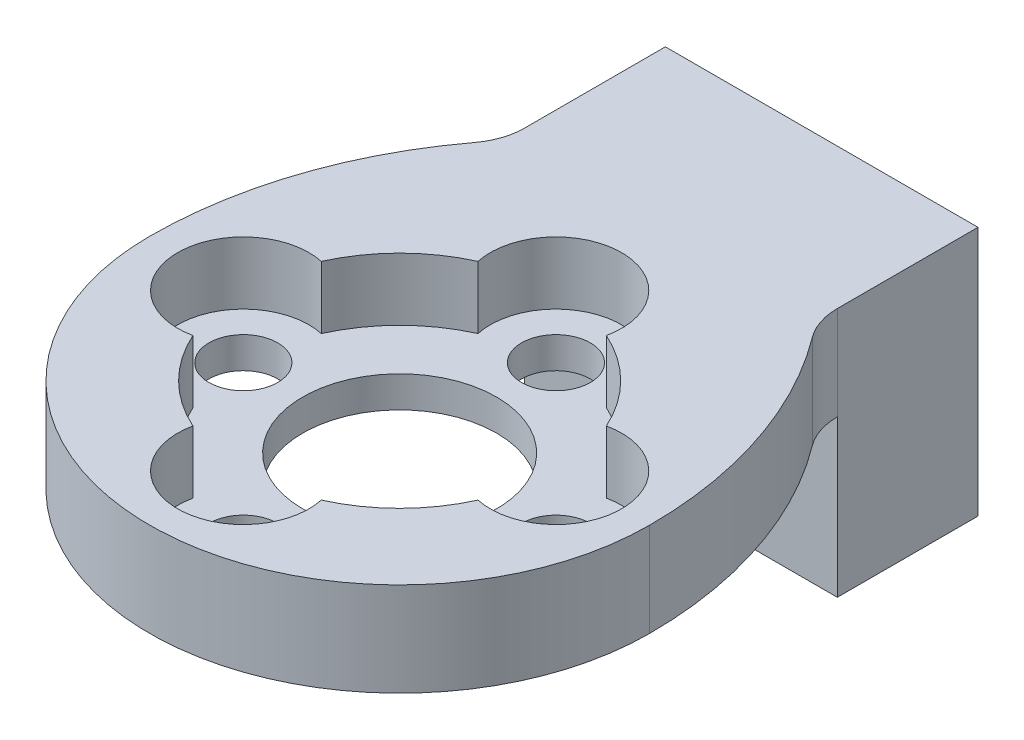
ISO-10303-21;
HEADER;
FILE_DESCRIPTION(('STEP AP214'),'2;1');
FILE_NAME('part.step','',(''),(''),'','','');
FILE_SCHEMA(('AUTOMOTIVE_DESIGN { 1 0 10303 214 1 1 1 1 }'));
ENDSEC;
DATA;
#1=APPLICATION_CONTEXT('core data for automotive mechanical design processes');
#2=APPLICATION_PROTOCOL_DEFINITION('international standard','automotive_design',2000,#1);
#3=PRODUCT_CONTEXT('',#1,'mechanical');
#4=PRODUCT('Part','Part','',(#3));
#5=PRODUCT_RELATED_PRODUCT_CATEGORY('part','',(#4));
#6=PRODUCT_DEFINITION_FORMATION('','',#4);
#7=PRODUCT_DEFINITION_CONTEXT('part definition',#1,'design');
#8=PRODUCT_DEFINITION('design','',#6,#7);
#9=PRODUCT_DEFINITION_SHAPE('','',#8);
#10=(LENGTH_UNIT() NAMED_UNIT(*) SI_UNIT(.MILLI.,.METRE.));
#11=(NAMED_UNIT(*) PLANE_ANGLE_UNIT() SI_UNIT($,.RADIAN.));
#12=(NAMED_UNIT(*) SI_UNIT($,.STERADIAN.) SOLID_ANGLE_UNIT());
#13=UNCERTAINTY_MEASURE_WITH_UNIT(LENGTH_MEASURE(1.E-05),#10,'distance_accuracy_value','');
#14=(GEOMETRIC_REPRESENTATION_CONTEXT(3) GLOBAL_UNCERTAINTY_ASSIGNED_CONTEXT((#13)) GLOBAL_UNIT_ASSIGNED_CONTEXT((#10,
#11,#12)) REPRESENTATION_CONTEXT('',''));
#15=CARTESIAN_POINT('',(0.,0.,0.));
#16=DIRECTION('',(0.,0.,1.));
#17=DIRECTION('',(1.,0.,0.));
#18=AXIS2_PLACEMENT_3D('',#15,#16,#17);
#19=CARTESIAN_POINT('',(-4.999999996736,0.,13.5));
#20=DIRECTION('',(0.,1.,0.));
#21=DIRECTION('',(0.,0.,1.));
#22=AXIS2_PLACEMENT_3D('',#19,#20,#21);
#23=PLANE('',#22);
#24=CARTESIAN_POINT('',(0.,0.,8.5));
#25=DIRECTION('',(0.,-1.,0.));
#26=DIRECTION('',(0.,0.,-1.));
#27=AXIS2_PLACEMENT_3D('',#24,#25,#26);
#28=CIRCLE('',#27,1.09999999999999);
#29=CARTESIAN_POINT('',(0.,0.,7.40000000000001));
#30=VERTEX_POINT('',#29);
#31=EDGE_CURVE('E170',#30,#30,#28,.T.);
#32=ORIENTED_EDGE('',*,*,#31,.F.);
#33=EDGE_LOOP('',(#32));
#34=FACE_BOUND('',#33,.T.);
#35=CARTESIAN_POINT('',(5.,0.,13.5));
#36=DIRECTION('',(0.,-1.,0.));
#37=DIRECTION('',(0.,0.,-1.));
#38=AXIS2_PLACEMENT_3D('',#35,#36,#37);
#39=CIRCLE('',#38,1.09999999999999);
#40=CARTESIAN_POINT('',(5.,0.,12.4));
#41=VERTEX_POINT('',#40);
#42=EDGE_CURVE('E174',#41,#41,#39,.T.);
#43=ORIENTED_EDGE('',*,*,#42,.F.);
#44=EDGE_LOOP('',(#43));
#45=FACE_BOUND('',#44,.T.);
#46=CARTESIAN_POINT('',(0.,0.,18.5));
#47=DIRECTION('',(0.,-1.,0.));
#48=DIRECTION('',(0.,0.,-1.));
#49=AXIS2_PLACEMENT_3D('',#46,#47,#48);
#50=CIRCLE('',#49,1.09999999999999);
#51=CARTESIAN_POINT('',(0.,0.,17.4));
#52=VERTEX_POINT('',#51);
#53=EDGE_CURVE('E178',#52,#52,#50,.T.);
#54=ORIENTED_EDGE('',*,*,#53,.F.);
#55=EDGE_LOOP('',(#54));
#56=FACE_BOUND('',#55,.T.);
#57=DIRECTION('',(-1.,0.,0.));
#58=VECTOR('',#57,1.);
#59=CARTESIAN_POINT('',(-5.,0.,4.5));
#60=LINE('',#59,#58);
#61=CARTESIAN_POINT('',(5.000000003264,0.,4.5));
#62=VERTEX_POINT('',#61);
#63=CARTESIAN_POINT('',(-5.,0.,4.5));
#64=VERTEX_POINT('',#63);
#65=EDGE_CURVE('E240',#62,#64,#60,.T.);
#66=ORIENTED_EDGE('',*,*,#65,.F.);
#67=CARTESIAN_POINT('',(7.000000003264,0.,4.5));
#68=DIRECTION('',(0.,1.,0.));
#69=DIRECTION('',(0.,0.,1.));
#70=AXIS2_PLACEMENT_3D('',#67,#68,#69);
#71=CIRCLE('',#70,2.);
#72=CARTESIAN_POINT('',(5.400000003264,0.,5.69999999999999));
#73=VERTEX_POINT('',#72);
#74=EDGE_CURVE('E314',#62,#73,#71,.T.);
#75=ORIENTED_EDGE('',*,*,#74,.T.);
#76=CARTESIAN_POINT('',(-4.999999996736,0.,13.5));
#77=DIRECTION('',(0.,1.,0.));
#78=DIRECTION('',(0.,0.,1.));
#79=AXIS2_PLACEMENT_3D('',#76,#77,#78);
#80=CIRCLE('',#79,13.);
#81=CARTESIAN_POINT('',(8.000000003264,0.,13.5));
#82=VERTEX_POINT('',#81);
#83=EDGE_CURVE('E268',#82,#73,#80,.T.);
#84=ORIENTED_EDGE('',*,*,#83,.F.);
#85=CARTESIAN_POINT('',(3.26400081725188E-09,0.,13.5));
#86=DIRECTION('',(0.,1.,0.));
#87=DIRECTION('',(0.,0.,1.));
#88=AXIS2_PLACEMENT_3D('',#85,#86,#87);
#89=CIRCLE('',#88,8.);
#90=CARTESIAN_POINT('',(-7.999999996736,0.,13.5));
#91=VERTEX_POINT('',#90);
#92=EDGE_CURVE('E365',#91,#82,#89,.T.);
#93=ORIENTED_EDGE('',*,*,#92,.F.);
#94=CARTESIAN_POINT('',(5.000000003264,0.,13.5));
#95=DIRECTION('',(0.,1.,0.));
#96=DIRECTION('',(0.,0.,1.));
#97=AXIS2_PLACEMENT_3D('',#94,#95,#96);
#98=CIRCLE('',#97,13.);
#99=CARTESIAN_POINT('',(-5.399999996736,0.,5.69999999999999));
#100=VERTEX_POINT('',#99);
#101=EDGE_CURVE('E333',#100,#91,#98,.T.);
#102=ORIENTED_EDGE('',*,*,#101,.F.);
#103=CARTESIAN_POINT('',(-6.99999999673599,0.,4.49999999999999));
#104=DIRECTION('',(0.,1.,0.));
#105=DIRECTION('',(0.,0.,1.));
#106=AXIS2_PLACEMENT_3D('',#103,#104,#105);
#107=CIRCLE('',#106,2.);
#108=EDGE_CURVE('E11',#100,#64,#107,.T.);
#109=ORIENTED_EDGE('',*,*,#108,.T.);
#110=EDGE_LOOP('',(#66,#75,#84,#93,#102,#109));
#111=FACE_BOUND('',#110,.T.);
#112=CARTESIAN_POINT('',(-5.,0.,13.5));
#113=DIRECTION('',(0.,1.,0.));
#114=DIRECTION('',(0.,0.,1.));
#115=AXIS2_PLACEMENT_3D('',#112,#113,#114);
#116=CIRCLE('',#115,1.09999999999999);
#117=CARTESIAN_POINT('',(-5.,0.,14.6));
#118=VERTEX_POINT('',#117);
#119=EDGE_CURVE('E189',#118,#118,#116,.T.);
#120=ORIENTED_EDGE('',*,*,#119,.T.);
#121=EDGE_LOOP('',(#120));
#122=FACE_BOUND('',#121,.T.);
#123=CARTESIAN_POINT('',(0.,0.,13.5));
#124=DIRECTION('',(0.,-1.,0.));
#125=DIRECTION('',(0.,0.,-1.));
#126=AXIS2_PLACEMENT_3D('',#123,#124,#125);
#127=CIRCLE('',#126,3.09999999999999);
#128=CARTESIAN_POINT('',(0.,0.,10.4));
#129=VERTEX_POINT('',#128);
#130=EDGE_CURVE('E182',#129,#129,#127,.T.);
#131=ORIENTED_EDGE('',*,*,#130,.F.);
#132=EDGE_LOOP('',(#131));
#133=FACE_BOUND('',#132,.T.);
#134=ADVANCED_FACE('F32',(#34,#45,#56,#111,#122,#133),#23,.F.);
#135=CARTESIAN_POINT('',(-4.999999996736,0.,13.5));
#136=DIRECTION('',(0.,1.,0.));
#137=DIRECTION('',(0.,0.,1.));
#138=AXIS2_PLACEMENT_3D('',#135,#136,#137);
#139=CYLINDRICAL_SURFACE('',#138,13.);
#140=ORIENTED_EDGE('',*,*,#83,.T.);
#141=DIRECTION('',(0.,1.,0.));
#142=VECTOR('',#141,1.);
#143=CARTESIAN_POINT('',(5.400000003264,0.,5.7));
#144=LINE('',#143,#142);
#145=CARTESIAN_POINT('',(5.400000003264,3.,5.69999999999999));
#146=VERTEX_POINT('',#145);
#147=EDGE_CURVE('E298',#73,#146,#144,.T.);
#148=ORIENTED_EDGE('',*,*,#147,.T.);
#149=CARTESIAN_POINT('',(-4.999999996736,3.,13.5));
#150=DIRECTION('',(0.,1.,0.));
#151=DIRECTION('',(0.,0.,1.));
#152=AXIS2_PLACEMENT_3D('',#149,#150,#151);
#153=CIRCLE('',#152,13.);
#154=CARTESIAN_POINT('',(8.000000003264,3.,13.5));
#155=VERTEX_POINT('',#154);
#156=EDGE_CURVE('E283',#155,#146,#153,.T.);
#157=ORIENTED_EDGE('',*,*,#156,.F.);
#158=DIRECTION('',(0.,1.,0.));
#159=VECTOR('',#158,1.);
#160=CARTESIAN_POINT('',(8.000000003264,0.,13.5));
#161=LINE('',#160,#159);
#162=EDGE_CURVE('E302',#82,#155,#161,.T.);
#163=ORIENTED_EDGE('',*,*,#162,.F.);
#164=EDGE_LOOP('',(#140,#148,#157,#163));
#165=FACE_BOUND('',#164,.T.);
#166=ADVANCED_FACE('F330',(#165),#139,.T.);
#167=CARTESIAN_POINT('',(3.26400081725188E-09,0.,13.5));
#168=DIRECTION('',(0.,1.,0.));
#169=DIRECTION('',(0.,0.,1.));
#170=AXIS2_PLACEMENT_3D('',#167,#168,#169);
#171=CYLINDRICAL_SURFACE('',#170,8.);
#172=CARTESIAN_POINT('',(3.26400081725188E-09,3.,13.5));
#173=DIRECTION('',(0.,1.,0.));
#174=DIRECTION('',(0.,0.,1.));
#175=AXIS2_PLACEMENT_3D('',#172,#173,#174);
#176=CIRCLE('',#175,8.);
#177=CARTESIAN_POINT('',(-7.999999996736,3.,13.5));
#178=VERTEX_POINT('',#177);
#179=EDGE_CURVE('E334',#178,#155,#176,.T.);
#180=ORIENTED_EDGE('',*,*,#179,.F.);
#181=DIRECTION('',(0.,1.,0.));
#182=VECTOR('',#181,1.);
#183=CARTESIAN_POINT('',(-7.999999996736,0.,13.5));
#184=LINE('',#183,#182);
#185=EDGE_CURVE('E359',#91,#178,#184,.T.);
#186=ORIENTED_EDGE('',*,*,#185,.F.);
#187=ORIENTED_EDGE('',*,*,#92,.T.);
#188=ORIENTED_EDGE('',*,*,#162,.T.);
#189=EDGE_LOOP('',(#180,#186,#187,#188));
#190=FACE_BOUND('',#189,.T.);
#191=ADVANCED_FACE('F371',(#190),#171,.T.);
#192=CARTESIAN_POINT('',(5.000000003264,0.,13.5));
#193=DIRECTION('',(0.,1.,0.));
#194=DIRECTION('',(0.,0.,1.));
#195=AXIS2_PLACEMENT_3D('',#192,#193,#194);
#196=CYLINDRICAL_SURFACE('',#195,13.);
#197=CARTESIAN_POINT('',(5.000000003264,3.,13.5));
#198=DIRECTION('',(0.,1.,0.));
#199=DIRECTION('',(0.,0.,1.));
#200=AXIS2_PLACEMENT_3D('',#197,#198,#199);
#201=CIRCLE('',#200,13.);
#202=CARTESIAN_POINT('',(-5.399999996736,3.,5.69999999999999));
#203=VERTEX_POINT('',#202);
#204=EDGE_CURVE('E355',#203,#178,#201,.T.);
#205=ORIENTED_EDGE('',*,*,#204,.F.);
#206=DIRECTION('',(0.,1.,0.));
#207=VECTOR('',#206,1.);
#208=CARTESIAN_POINT('',(-5.39999999673599,0.,5.7));
#209=LINE('',#208,#207);
#210=EDGE_CURVE('E48',#203,#100,#209,.F.);
#211=ORIENTED_EDGE('',*,*,#210,.T.);
#212=ORIENTED_EDGE('',*,*,#101,.T.);
#213=ORIENTED_EDGE('',*,*,#185,.T.);
#214=EDGE_LOOP('',(#205,#211,#212,#213));
#215=FACE_BOUND('',#214,.T.);
#216=ADVANCED_FACE('F368',(#215),#196,.T.);
#217=CARTESIAN_POINT('',(-4.999999996736,0.,0.));
#218=DIRECTION('',(-1.,0.,0.));
#219=DIRECTION('',(0.,0.,1.));
#220=AXIS2_PLACEMENT_3D('',#217,#218,#219);
#221=PLANE('',#220);
#222=DIRECTION('',(0.,1.,0.));
#223=VECTOR('',#222,1.);
#224=CARTESIAN_POINT('',(-5.,-5.,4.5));
#225=LINE('',#224,#223);
#226=CARTESIAN_POINT('',(-5.,-5.,4.5));
#227=VERTEX_POINT('',#226);
#228=EDGE_CURVE('E265',#227,#64,#225,.T.);
#229=ORIENTED_EDGE('',*,*,#228,.T.);
#230=DIRECTION('',(0.,-1.,0.));
#231=VECTOR('',#230,1.);
#232=CARTESIAN_POINT('',(-4.999999996736,3.,4.49999999999999));
#233=LINE('',#232,#231);
#234=CARTESIAN_POINT('',(-4.999999996736,3.,4.49999999999999));
#235=VERTEX_POINT('',#234);
#236=EDGE_CURVE('E304',#64,#235,#233,.F.);
#237=ORIENTED_EDGE('',*,*,#236,.T.);
#238=DIRECTION('',(0.,0.,1.));
#239=VECTOR('',#238,1.);
#240=CARTESIAN_POINT('',(-4.999999996736,3.,0.));
#241=LINE('',#240,#239);
#242=CARTESIAN_POINT('',(-4.999999996736,3.,0.));
#243=VERTEX_POINT('',#242);
#244=EDGE_CURVE('E349',#243,#235,#241,.T.);
#245=ORIENTED_EDGE('',*,*,#244,.F.);
#246=DIRECTION('',(0.,1.,0.));
#247=VECTOR('',#246,1.);
#248=CARTESIAN_POINT('',(-4.999999996736,0.,0.));
#249=LINE('',#248,#247);
#250=CARTESIAN_POINT('',(-5.,-5.,0.));
#251=VERTEX_POINT('',#250);
#252=EDGE_CURVE('E361',#251,#243,#249,.T.);
#253=ORIENTED_EDGE('',*,*,#252,.F.);
#254=DIRECTION('',(0.,0.,-1.));
#255=VECTOR('',#254,1.);
#256=CARTESIAN_POINT('',(-5.,-5.,0.));
#257=LINE('',#256,#255);
#258=EDGE_CURVE('E262',#227,#251,#257,.T.);
#259=ORIENTED_EDGE('',*,*,#258,.F.);
#260=EDGE_LOOP('',(#229,#237,#245,#253,#259));
#261=FACE_BOUND('',#260,.T.);
#262=ADVANCED_FACE('F380',(#261),#221,.T.);
#263=CARTESIAN_POINT('',(5.000000003264,0.,0.));
#264=DIRECTION('',(0.,0.,-1.));
#265=DIRECTION('',(-1.,0.,0.));
#266=AXIS2_PLACEMENT_3D('',#263,#264,#265);
#267=PLANE('',#266);
#268=CARTESIAN_POINT('',(-3.,1.,0.));
#269=DIRECTION('',(0.,0.,-1.));
#270=DIRECTION('',(-1.,0.,0.));
#271=AXIS2_PLACEMENT_3D('',#268,#269,#270);
#272=CIRCLE('',#271,0.79999999999999);
#273=CARTESIAN_POINT('',(-3.79999999999999,1.,0.));
#274=VERTEX_POINT('',#273);
#275=EDGE_CURVE('E162',#274,#274,#272,.T.);
#276=ORIENTED_EDGE('',*,*,#275,.F.);
#277=EDGE_LOOP('',(#276));
#278=FACE_BOUND('',#277,.T.);
#279=CARTESIAN_POINT('',(1.5,-2.,0.));
#280=DIRECTION('',(0.,0.,-1.));
#281=DIRECTION('',(-1.,0.,0.));
#282=AXIS2_PLACEMENT_3D('',#279,#280,#281);
#283=CIRCLE('',#282,1.24999999999999);
#284=CARTESIAN_POINT('',(0.250000000000013,-2.,0.));
#285=VERTEX_POINT('',#284);
#286=EDGE_CURVE('E161',#285,#285,#283,.T.);
#287=ORIENTED_EDGE('',*,*,#286,.F.);
#288=EDGE_LOOP('',(#287));
#289=FACE_BOUND('',#288,.T.);
#290=DIRECTION('',(-1.,0.,0.));
#291=VECTOR('',#290,1.);
#292=CARTESIAN_POINT('',(5.000000003264,3.,0.));
#293=LINE('',#292,#291);
#294=CARTESIAN_POINT('',(5.000000003264,3.,0.));
#295=VERTEX_POINT('',#294);
#296=EDGE_CURVE('E347',#295,#243,#293,.T.);
#297=ORIENTED_EDGE('',*,*,#296,.F.);
#298=DIRECTION('',(0.,1.,0.));
#299=VECTOR('',#298,1.);
#300=CARTESIAN_POINT('',(5.000000003264,0.,0.));
#301=LINE('',#300,#299);
#302=CARTESIAN_POINT('',(5.,-5.,0.));
#303=VERTEX_POINT('',#302);
#304=EDGE_CURVE('E274',#303,#295,#301,.T.);
#305=ORIENTED_EDGE('',*,*,#304,.F.);
#306=DIRECTION('',(1.,0.,0.));
#307=VECTOR('',#306,1.);
#308=CARTESIAN_POINT('',(5.,-5.,0.));
#309=LINE('',#308,#307);
#310=EDGE_CURVE('E255',#251,#303,#309,.T.);
#311=ORIENTED_EDGE('',*,*,#310,.F.);
#312=ORIENTED_EDGE('',*,*,#252,.T.);
#313=EDGE_LOOP('',(#297,#305,#311,#312));
#314=FACE_BOUND('',#313,.T.);
#315=ADVANCED_FACE('F383',(#278,#289,#314),#267,.T.);
#316=CARTESIAN_POINT('',(5.000000003264,0.,5.19337613708192));
#317=DIRECTION('',(1.,0.,0.));
#318=DIRECTION('',(0.,0.,-1.));
#319=AXIS2_PLACEMENT_3D('',#316,#317,#318);
#320=PLANE('',#319);
#321=DIRECTION('',(0.,0.,-1.));
#322=VECTOR('',#321,1.);
#323=CARTESIAN_POINT('',(5.000000003264,3.,5.19337613708192));
#324=LINE('',#323,#322);
#325=CARTESIAN_POINT('',(5.000000003264,3.,4.5));
#326=VERTEX_POINT('',#325);
#327=EDGE_CURVE('E339',#326,#295,#324,.T.);
#328=ORIENTED_EDGE('',*,*,#327,.F.);
#329=DIRECTION('',(0.,-1.,0.));
#330=VECTOR('',#329,1.);
#331=CARTESIAN_POINT('',(5.000000003264,0.,4.5));
#332=LINE('',#331,#330);
#333=EDGE_CURVE('E301',#326,#62,#332,.T.);
#334=ORIENTED_EDGE('',*,*,#333,.T.);
#335=DIRECTION('',(0.,1.,0.));
#336=VECTOR('',#335,1.);
#337=CARTESIAN_POINT('',(5.,-5.,4.5));
#338=LINE('',#337,#336);
#339=CARTESIAN_POINT('',(5.,-5.,4.5));
#340=VERTEX_POINT('',#339);
#341=EDGE_CURVE('E278',#340,#62,#338,.T.);
#342=ORIENTED_EDGE('',*,*,#341,.F.);
#343=DIRECTION('',(0.,0.,1.));
#344=VECTOR('',#343,1.);
#345=CARTESIAN_POINT('',(5.,-5.,4.5));
#346=LINE('',#345,#344);
#347=EDGE_CURVE('E258',#303,#340,#346,.T.);
#348=ORIENTED_EDGE('',*,*,#347,.F.);
#349=ORIENTED_EDGE('',*,*,#304,.T.);
#350=EDGE_LOOP('',(#328,#334,#342,#348,#349));
#351=FACE_BOUND('',#350,.T.);
#352=ADVANCED_FACE('F343',(#351),#320,.T.);
#353=CARTESIAN_POINT('',(-4.999999996736,3.,13.5));
#354=DIRECTION('',(0.,1.,0.));
#355=DIRECTION('',(0.,0.,1.));
#356=AXIS2_PLACEMENT_3D('',#353,#354,#355);
#357=PLANE('',#356);
#358=CARTESIAN_POINT('',(6.45928025720713E-10,3.,18.499999999823));
#359=DIRECTION('',(0.,1.,0.));
#360=DIRECTION('',(0.,0.,1.));
#361=AXIS2_PLACEMENT_3D('',#358,#359,#360);
#362=CIRCLE('',#361,2.10000000059128);
#363=CARTESIAN_POINT('',(-2.05317291032483,3.,18.0589999996652));
#364=VERTEX_POINT('',#363);
#365=CARTESIAN_POINT('',(2.05317291150274,3.,18.0589999991347));
#366=VERTEX_POINT('',#365);
#367=EDGE_CURVE('E216',#364,#366,#362,.T.);
#368=ORIENTED_EDGE('',*,*,#367,.F.);
#369=CARTESIAN_POINT('',(0.,3.,13.4999999996314));
#370=DIRECTION('',(0.,1.,0.));
#371=DIRECTION('',(0.,0.,1.));
#372=AXIS2_PLACEMENT_3D('',#369,#370,#371);
#373=CIRCLE('',#372,5.);
#374=CARTESIAN_POINT('',(-4.55899999989825,3.,15.5531729102572));
#375=VERTEX_POINT('',#374);
#376=EDGE_CURVE('E194',#375,#364,#373,.T.);
#377=ORIENTED_EDGE('',*,*,#376,.F.);
#378=CARTESIAN_POINT('',(-5.,3.,13.4999999999197));
#379=DIRECTION('',(0.,1.,0.));
#380=DIRECTION('',(0.,0.,1.));
#381=AXIS2_PLACEMENT_3D('',#378,#379,#380);
#382=CIRCLE('',#381,2.09999999996042);
#383=CARTESIAN_POINT('',(-4.559000000135,3.,11.4468270895312));
#384=VERTEX_POINT('',#383);
#385=EDGE_CURVE('E233',#384,#375,#382,.T.);
#386=ORIENTED_EDGE('',*,*,#385,.F.);
#387=CARTESIAN_POINT('',(0.,3.,13.4999999996314));
#388=DIRECTION('',(0.,1.,0.));
#389=DIRECTION('',(0.,0.,1.));
#390=AXIS2_PLACEMENT_3D('',#387,#388,#389);
#391=CIRCLE('',#390,5.);
#392=CARTESIAN_POINT('',(-2.05317291015831,3.,8.94099999952258));
#393=VERTEX_POINT('',#392);
#394=EDGE_CURVE('E230',#393,#384,#391,.T.);
#395=ORIENTED_EDGE('',*,*,#394,.F.);
#396=CARTESIAN_POINT('',(2.24483105167808E-10,3.,8.49999999963138));
#397=DIRECTION('',(0.,1.,0.));
#398=DIRECTION('',(0.,0.,1.));
#399=AXIS2_PLACEMENT_3D('',#396,#397,#398);
#400=CIRCLE('',#399,2.09999999996043);
#401=CARTESIAN_POINT('',(2.05317291056768,3.,8.94099999970694));
#402=VERTEX_POINT('',#401);
#403=EDGE_CURVE('E227',#402,#393,#400,.T.);
#404=ORIENTED_EDGE('',*,*,#403,.F.);
#405=CARTESIAN_POINT('',(0.,3.,13.4999999996314));
#406=DIRECTION('',(0.,1.,0.));
#407=DIRECTION('',(0.,0.,1.));
#408=AXIS2_PLACEMENT_3D('',#405,#406,#407);
#409=CIRCLE('',#408,5.);
#410=CARTESIAN_POINT('',(4.55900000016799,3.,11.4468270896045));
#411=VERTEX_POINT('',#410);
#412=EDGE_CURVE('E224',#411,#402,#409,.T.);
#413=ORIENTED_EDGE('',*,*,#412,.F.);
#414=CARTESIAN_POINT('',(5.,3.,13.5));
#415=DIRECTION('',(0.,1.,0.));
#416=DIRECTION('',(0.,0.,1.));
#417=AXIS2_PLACEMENT_3D('',#414,#415,#416);
#418=CIRCLE('',#417,2.09999999996042);
#419=CARTESIAN_POINT('',(4.55899999986525,3.,15.5531729103305));
#420=VERTEX_POINT('',#419);
#421=EDGE_CURVE('E221',#420,#411,#418,.T.);
#422=ORIENTED_EDGE('',*,*,#421,.F.);
#423=CARTESIAN_POINT('',(0.,3.,13.4999999996314));
#424=DIRECTION('',(0.,1.,0.));
#425=DIRECTION('',(0.,0.,1.));
#426=AXIS2_PLACEMENT_3D('',#423,#424,#425);
#427=CIRCLE('',#426,5.);
#428=EDGE_CURVE('E218',#366,#420,#427,.T.);
#429=ORIENTED_EDGE('',*,*,#428,.F.);
#430=EDGE_LOOP('',(#368,#377,#386,#395,#404,#413,#422,#429));
#431=FACE_BOUND('',#430,.T.);
#432=ORIENTED_EDGE('',*,*,#156,.T.);
#433=CARTESIAN_POINT('',(7.000000003264,3.,4.5));
#434=DIRECTION('',(0.,1.,0.));
#435=DIRECTION('',(0.,0.,1.));
#436=AXIS2_PLACEMENT_3D('',#433,#434,#435);
#437=CIRCLE('',#436,2.);
#438=EDGE_CURVE('E312',#146,#326,#437,.F.);
#439=ORIENTED_EDGE('',*,*,#438,.T.);
#440=ORIENTED_EDGE('',*,*,#327,.T.);
#441=ORIENTED_EDGE('',*,*,#296,.T.);
#442=ORIENTED_EDGE('',*,*,#244,.T.);
#443=CARTESIAN_POINT('',(-6.99999999673599,3.,4.49999999999999));
#444=DIRECTION('',(0.,1.,0.));
#445=DIRECTION('',(0.,0.,1.));
#446=AXIS2_PLACEMENT_3D('',#443,#444,#445);
#447=CIRCLE('',#446,2.);
#448=EDGE_CURVE('E41',#235,#203,#447,.F.);
#449=ORIENTED_EDGE('',*,*,#448,.T.);
#450=ORIENTED_EDGE('',*,*,#204,.T.);
#451=ORIENTED_EDGE('',*,*,#179,.T.);
#452=EDGE_LOOP('',(#432,#439,#440,#441,#442,#449,#450,#451));
#453=FACE_BOUND('',#452,.T.);
#454=ADVANCED_FACE('F337',(#431,#453),#357,.T.);
#455=CARTESIAN_POINT('',(-5.,-5.,4.5));
#456=DIRECTION('',(0.,0.,-1.));
#457=DIRECTION('',(-1.,0.,0.));
#458=AXIS2_PLACEMENT_3D('',#455,#456,#457);
#459=PLANE('',#458);
#460=CARTESIAN_POINT('',(1.5,-2.,4.5));
#461=DIRECTION('',(0.,0.,-1.));
#462=DIRECTION('',(-1.,0.,0.));
#463=AXIS2_PLACEMENT_3D('',#460,#461,#462);
#464=CIRCLE('',#463,1.24999999999999);
#465=CARTESIAN_POINT('',(0.250000000000014,-2.,4.5));
#466=VERTEX_POINT('',#465);
#467=EDGE_CURVE('E165',#466,#466,#464,.T.);
#468=ORIENTED_EDGE('',*,*,#467,.T.);
#469=EDGE_LOOP('',(#468));
#470=FACE_BOUND('',#469,.T.);
#471=ORIENTED_EDGE('',*,*,#65,.T.);
#472=ORIENTED_EDGE('',*,*,#228,.F.);
#473=DIRECTION('',(-1.,0.,0.));
#474=VECTOR('',#473,1.);
#475=CARTESIAN_POINT('',(-5.,-5.,4.5));
#476=LINE('',#475,#474);
#477=EDGE_CURVE('E260',#340,#227,#476,.T.);
#478=ORIENTED_EDGE('',*,*,#477,.F.);
#479=ORIENTED_EDGE('',*,*,#341,.T.);
#480=EDGE_LOOP('',(#471,#472,#478,#479));
#481=FACE_BOUND('',#480,.T.);
#482=ADVANCED_FACE('F376',(#470,#481),#459,.F.);
#483=CARTESIAN_POINT('',(0.,-5.,0.));
#484=DIRECTION('',(0.,1.,0.));
#485=DIRECTION('',(0.,0.,1.));
#486=AXIS2_PLACEMENT_3D('',#483,#484,#485);
#487=PLANE('',#486);
#488=ORIENTED_EDGE('',*,*,#310,.T.);
#489=ORIENTED_EDGE('',*,*,#347,.T.);
#490=ORIENTED_EDGE('',*,*,#477,.T.);
#491=ORIENTED_EDGE('',*,*,#258,.T.);
#492=EDGE_LOOP('',(#488,#489,#490,#491));
#493=FACE_BOUND('',#492,.T.);
#494=ADVANCED_FACE('F382',(#493),#487,.F.);
#495=CARTESIAN_POINT('',(6.45928025720713E-10,1.,18.499999999823));
#496=DIRECTION('',(0.,1.,0.));
#497=DIRECTION('',(0.,0.,1.));
#498=AXIS2_PLACEMENT_3D('',#495,#496,#497);
#499=CYLINDRICAL_SURFACE('',#498,2.10000000059128);
#500=ORIENTED_EDGE('',*,*,#367,.T.);
#501=DIRECTION('',(0.,1.,0.));
#502=VECTOR('',#501,1.);
#503=CARTESIAN_POINT('',(2.05317291150274,1.,18.0589999991347));
#504=LINE('',#503,#502);
#505=CARTESIAN_POINT('',(2.05317291150274,1.,18.0589999991347));
#506=VERTEX_POINT('',#505);
#507=EDGE_CURVE('E215',#506,#366,#504,.T.);
#508=ORIENTED_EDGE('',*,*,#507,.F.);
#509=CARTESIAN_POINT('',(6.45928025720713E-10,1.,18.499999999823));
#510=DIRECTION('',(0.,1.,0.));
#511=DIRECTION('',(0.,0.,1.));
#512=AXIS2_PLACEMENT_3D('',#509,#510,#511);
#513=CIRCLE('',#512,2.10000000059128);
#514=CARTESIAN_POINT('',(-2.05317291032483,1.,18.0589999996652));
#515=VERTEX_POINT('',#514);
#516=EDGE_CURVE('E190',#515,#506,#513,.T.);
#517=ORIENTED_EDGE('',*,*,#516,.F.);
#518=DIRECTION('',(0.,1.,0.));
#519=VECTOR('',#518,1.);
#520=CARTESIAN_POINT('',(-2.05317291032483,1.,18.0589999996652));
#521=LINE('',#520,#519);
#522=EDGE_CURVE('E238',#515,#364,#521,.T.);
#523=ORIENTED_EDGE('',*,*,#522,.T.);
#524=EDGE_LOOP('',(#500,#508,#517,#523));
#525=FACE_BOUND('',#524,.T.);
#526=ADVANCED_FACE('F583',(#525),#499,.F.);
#527=CARTESIAN_POINT('',(0.,1.,13.4999999996314));
#528=DIRECTION('',(0.,1.,0.));
#529=DIRECTION('',(0.,0.,1.));
#530=AXIS2_PLACEMENT_3D('',#527,#528,#529);
#531=CYLINDRICAL_SURFACE('',#530,5.);
#532=ORIENTED_EDGE('',*,*,#376,.T.);
#533=ORIENTED_EDGE('',*,*,#522,.F.);
#534=CARTESIAN_POINT('',(0.,1.,13.4999999996314));
#535=DIRECTION('',(0.,1.,0.));
#536=DIRECTION('',(0.,0.,1.));
#537=AXIS2_PLACEMENT_3D('',#534,#535,#536);
#538=CIRCLE('',#537,5.);
#539=CARTESIAN_POINT('',(-4.55899999989825,1.,15.5531729102572));
#540=VERTEX_POINT('',#539);
#541=EDGE_CURVE('E212',#540,#515,#538,.T.);
#542=ORIENTED_EDGE('',*,*,#541,.F.);
#543=DIRECTION('',(0.,1.,0.));
#544=VECTOR('',#543,1.);
#545=CARTESIAN_POINT('',(-4.55899999989825,1.,15.5531729102572));
#546=LINE('',#545,#544);
#547=EDGE_CURVE('E241',#540,#375,#546,.T.);
#548=ORIENTED_EDGE('',*,*,#547,.T.);
#549=EDGE_LOOP('',(#532,#533,#542,#548));
#550=FACE_BOUND('',#549,.T.);
#551=ADVANCED_FACE('F575',(#550),#531,.F.);
#552=CARTESIAN_POINT('',(-5.,1.,13.4999999999197));
#553=DIRECTION('',(0.,1.,0.));
#554=DIRECTION('',(0.,0.,1.));
#555=AXIS2_PLACEMENT_3D('',#552,#553,#554);
#556=CYLINDRICAL_SURFACE('',#555,2.09999999996042);
#557=ORIENTED_EDGE('',*,*,#385,.T.);
#558=ORIENTED_EDGE('',*,*,#547,.F.);
#559=CARTESIAN_POINT('',(-5.,1.,13.4999999999197));
#560=DIRECTION('',(0.,1.,0.));
#561=DIRECTION('',(0.,0.,1.));
#562=AXIS2_PLACEMENT_3D('',#559,#560,#561);
#563=CIRCLE('',#562,2.09999999996042);
#564=CARTESIAN_POINT('',(-4.559000000135,1.,11.4468270895312));
#565=VERTEX_POINT('',#564);
#566=EDGE_CURVE('E209',#565,#540,#563,.T.);
#567=ORIENTED_EDGE('',*,*,#566,.F.);
#568=DIRECTION('',(0.,1.,0.));
#569=VECTOR('',#568,1.);
#570=CARTESIAN_POINT('',(-4.559000000135,1.,11.4468270895312));
#571=LINE('',#570,#569);
#572=EDGE_CURVE('E243',#565,#384,#571,.T.);
#573=ORIENTED_EDGE('',*,*,#572,.T.);
#574=EDGE_LOOP('',(#557,#558,#567,#573));
#575=FACE_BOUND('',#574,.T.);
#576=ADVANCED_FACE('F567',(#575),#556,.F.);
#577=CARTESIAN_POINT('',(0.,1.,13.4999999996314));
#578=DIRECTION('',(0.,1.,0.));
#579=DIRECTION('',(0.,0.,1.));
#580=AXIS2_PLACEMENT_3D('',#577,#578,#579);
#581=CYLINDRICAL_SURFACE('',#580,5.);
#582=ORIENTED_EDGE('',*,*,#394,.T.);
#583=ORIENTED_EDGE('',*,*,#572,.F.);
#584=CARTESIAN_POINT('',(0.,1.,13.4999999996314));
#585=DIRECTION('',(0.,1.,0.));
#586=DIRECTION('',(0.,0.,1.));
#587=AXIS2_PLACEMENT_3D('',#584,#585,#586);
#588=CIRCLE('',#587,5.);
#589=CARTESIAN_POINT('',(-2.05317291015831,1.,8.94099999952258));
#590=VERTEX_POINT('',#589);
#591=EDGE_CURVE('E206',#590,#565,#588,.T.);
#592=ORIENTED_EDGE('',*,*,#591,.F.);
#593=DIRECTION('',(0.,1.,0.));
#594=VECTOR('',#593,1.);
#595=CARTESIAN_POINT('',(-2.05317291015831,1.,8.94099999952258));
#596=LINE('',#595,#594);
#597=EDGE_CURVE('E245',#590,#393,#596,.T.);
#598=ORIENTED_EDGE('',*,*,#597,.T.);
#599=EDGE_LOOP('',(#582,#583,#592,#598));
#600=FACE_BOUND('',#599,.T.);
#601=ADVANCED_FACE('F559',(#600),#581,.F.);
#602=CARTESIAN_POINT('',(2.24483105167808E-10,1.,8.49999999963138));
#603=DIRECTION('',(0.,1.,0.));
#604=DIRECTION('',(0.,0.,1.));
#605=AXIS2_PLACEMENT_3D('',#602,#603,#604);
#606=CYLINDRICAL_SURFACE('',#605,2.09999999996043);
#607=ORIENTED_EDGE('',*,*,#403,.T.);
#608=ORIENTED_EDGE('',*,*,#597,.F.);
#609=CARTESIAN_POINT('',(2.24483105167808E-10,1.,8.49999999963138));
#610=DIRECTION('',(0.,1.,0.));
#611=DIRECTION('',(0.,0.,1.));
#612=AXIS2_PLACEMENT_3D('',#609,#610,#611);
#613=CIRCLE('',#612,2.09999999996043);
#614=CARTESIAN_POINT('',(2.05317291056768,1.,8.94099999970694));
#615=VERTEX_POINT('',#614);
#616=EDGE_CURVE('E203',#615,#590,#613,.T.);
#617=ORIENTED_EDGE('',*,*,#616,.F.);
#618=DIRECTION('',(0.,1.,0.));
#619=VECTOR('',#618,1.);
#620=CARTESIAN_POINT('',(2.05317291056768,1.,8.94099999970694));
#621=LINE('',#620,#619);
#622=EDGE_CURVE('E247',#615,#402,#621,.T.);
#623=ORIENTED_EDGE('',*,*,#622,.T.);
#624=EDGE_LOOP('',(#607,#608,#617,#623));
#625=FACE_BOUND('',#624,.T.);
#626=ADVANCED_FACE('F551',(#625),#606,.F.);
#627=CARTESIAN_POINT('',(0.,1.,13.4999999996314));
#628=DIRECTION('',(0.,1.,0.));
#629=DIRECTION('',(0.,0.,1.));
#630=AXIS2_PLACEMENT_3D('',#627,#628,#629);
#631=CYLINDRICAL_SURFACE('',#630,5.);
#632=ORIENTED_EDGE('',*,*,#412,.T.);
#633=ORIENTED_EDGE('',*,*,#622,.F.);
#634=CARTESIAN_POINT('',(0.,1.,13.4999999996314));
#635=DIRECTION('',(0.,1.,0.));
#636=DIRECTION('',(0.,0.,1.));
#637=AXIS2_PLACEMENT_3D('',#634,#635,#636);
#638=CIRCLE('',#637,5.);
#639=CARTESIAN_POINT('',(4.55900000016799,1.,11.4468270896045));
#640=VERTEX_POINT('',#639);
#641=EDGE_CURVE('E200',#640,#615,#638,.T.);
#642=ORIENTED_EDGE('',*,*,#641,.F.);
#643=DIRECTION('',(0.,1.,0.));
#644=VECTOR('',#643,1.);
#645=CARTESIAN_POINT('',(4.55900000016799,1.,11.4468270896045));
#646=LINE('',#645,#644);
#647=EDGE_CURVE('E249',#640,#411,#646,.T.);
#648=ORIENTED_EDGE('',*,*,#647,.T.);
#649=EDGE_LOOP('',(#632,#633,#642,#648));
#650=FACE_BOUND('',#649,.T.);
#651=ADVANCED_FACE('F543',(#650),#631,.F.);
#652=CARTESIAN_POINT('',(5.,1.,13.5));
#653=DIRECTION('',(0.,1.,0.));
#654=DIRECTION('',(0.,0.,1.));
#655=AXIS2_PLACEMENT_3D('',#652,#653,#654);
#656=CYLINDRICAL_SURFACE('',#655,2.09999999996042);
#657=ORIENTED_EDGE('',*,*,#421,.T.);
#658=ORIENTED_EDGE('',*,*,#647,.F.);
#659=CARTESIAN_POINT('',(5.,1.,13.5));
#660=DIRECTION('',(0.,1.,0.));
#661=DIRECTION('',(0.,0.,1.));
#662=AXIS2_PLACEMENT_3D('',#659,#660,#661);
#663=CIRCLE('',#662,2.09999999996042);
#664=CARTESIAN_POINT('',(4.55899999986525,1.,15.5531729103305));
#665=VERTEX_POINT('',#664);
#666=EDGE_CURVE('E197',#665,#640,#663,.T.);
#667=ORIENTED_EDGE('',*,*,#666,.F.);
#668=DIRECTION('',(0.,1.,0.));
#669=VECTOR('',#668,1.);
#670=CARTESIAN_POINT('',(4.55899999986525,1.,15.5531729103305));
#671=LINE('',#670,#669);
#672=EDGE_CURVE('E251',#665,#420,#671,.T.);
#673=ORIENTED_EDGE('',*,*,#672,.T.);
#674=EDGE_LOOP('',(#657,#658,#667,#673));
#675=FACE_BOUND('',#674,.T.);
#676=ADVANCED_FACE('F535',(#675),#656,.F.);
#677=CARTESIAN_POINT('',(0.,1.,13.4999999996314));
#678=DIRECTION('',(0.,1.,0.));
#679=DIRECTION('',(0.,0.,1.));
#680=AXIS2_PLACEMENT_3D('',#677,#678,#679);
#681=CYLINDRICAL_SURFACE('',#680,5.);
#682=ORIENTED_EDGE('',*,*,#428,.T.);
#683=ORIENTED_EDGE('',*,*,#672,.F.);
#684=CARTESIAN_POINT('',(0.,1.,13.4999999996314));
#685=DIRECTION('',(0.,1.,0.));
#686=DIRECTION('',(0.,0.,1.));
#687=AXIS2_PLACEMENT_3D('',#684,#685,#686);
#688=CIRCLE('',#687,5.);
#689=EDGE_CURVE('E193',#506,#665,#688,.T.);
#690=ORIENTED_EDGE('',*,*,#689,.F.);
#691=ORIENTED_EDGE('',*,*,#507,.T.);
#692=EDGE_LOOP('',(#682,#683,#690,#691));
#693=FACE_BOUND('',#692,.T.);
#694=ADVANCED_FACE('F528',(#693),#681,.F.);
#695=CARTESIAN_POINT('',(3.22963579179487E-10,1.,15.9999999997272));
#696=DIRECTION('',(0.,1.,0.));
#697=DIRECTION('',(0.,0.,1.));
#698=AXIS2_PLACEMENT_3D('',#695,#696,#697);
#699=PLANE('',#698);
#700=CARTESIAN_POINT('',(0.,1.,8.5));
#701=DIRECTION('',(0.,1.,0.));
#702=DIRECTION('',(0.,0.,1.));
#703=AXIS2_PLACEMENT_3D('',#700,#701,#702);
#704=CIRCLE('',#703,1.09999999999999);
#705=CARTESIAN_POINT('',(0.,1.,9.59999999999999));
#706=VERTEX_POINT('',#705);
#707=EDGE_CURVE('E173',#706,#706,#704,.T.);
#708=ORIENTED_EDGE('',*,*,#707,.F.);
#709=EDGE_LOOP('',(#708));
#710=FACE_BOUND('',#709,.T.);
#711=CARTESIAN_POINT('',(5.,1.,13.5));
#712=DIRECTION('',(0.,1.,0.));
#713=DIRECTION('',(0.,0.,1.));
#714=AXIS2_PLACEMENT_3D('',#711,#712,#713);
#715=CIRCLE('',#714,1.09999999999999);
#716=CARTESIAN_POINT('',(5.,1.,14.6));
#717=VERTEX_POINT('',#716);
#718=EDGE_CURVE('E177',#717,#717,#715,.T.);
#719=ORIENTED_EDGE('',*,*,#718,.F.);
#720=EDGE_LOOP('',(#719));
#721=FACE_BOUND('',#720,.T.);
#722=CARTESIAN_POINT('',(0.,1.,18.5));
#723=DIRECTION('',(0.,1.,0.));
#724=DIRECTION('',(0.,0.,1.));
#725=AXIS2_PLACEMENT_3D('',#722,#723,#724);
#726=CIRCLE('',#725,1.09999999999999);
#727=CARTESIAN_POINT('',(0.,1.,19.6));
#728=VERTEX_POINT('',#727);
#729=EDGE_CURVE('E181',#728,#728,#726,.T.);
#730=ORIENTED_EDGE('',*,*,#729,.F.);
#731=EDGE_LOOP('',(#730));
#732=FACE_BOUND('',#731,.T.);
#733=CARTESIAN_POINT('',(0.,1.,13.5));
#734=DIRECTION('',(0.,1.,0.));
#735=DIRECTION('',(0.,0.,1.));
#736=AXIS2_PLACEMENT_3D('',#733,#734,#735);
#737=CIRCLE('',#736,3.09999999999999);
#738=CARTESIAN_POINT('',(0.,1.,16.6));
#739=VERTEX_POINT('',#738);
#740=EDGE_CURVE('E185',#739,#739,#737,.T.);
#741=ORIENTED_EDGE('',*,*,#740,.F.);
#742=EDGE_LOOP('',(#741));
#743=FACE_BOUND('',#742,.T.);
#744=CARTESIAN_POINT('',(-5.,1.,13.5));
#745=DIRECTION('',(0.,1.,0.));
#746=DIRECTION('',(0.,0.,1.));
#747=AXIS2_PLACEMENT_3D('',#744,#745,#746);
#748=CIRCLE('',#747,1.09999999999999);
#749=CARTESIAN_POINT('',(-5.,1.,14.6));
#750=VERTEX_POINT('',#749);
#751=EDGE_CURVE('E186',#750,#750,#748,.T.);
#752=ORIENTED_EDGE('',*,*,#751,.F.);
#753=EDGE_LOOP('',(#752));
#754=FACE_BOUND('',#753,.T.);
#755=ORIENTED_EDGE('',*,*,#516,.T.);
#756=ORIENTED_EDGE('',*,*,#689,.T.);
#757=ORIENTED_EDGE('',*,*,#666,.T.);
#758=ORIENTED_EDGE('',*,*,#641,.T.);
#759=ORIENTED_EDGE('',*,*,#616,.T.);
#760=ORIENTED_EDGE('',*,*,#591,.T.);
#761=ORIENTED_EDGE('',*,*,#566,.T.);
#762=ORIENTED_EDGE('',*,*,#541,.T.);
#763=EDGE_LOOP('',(#755,#756,#757,#758,#759,#760,#761,#762));
#764=FACE_BOUND('',#763,.T.);
#765=ADVANCED_FACE('F520',(#710,#721,#732,#743,#754,#764),#699,.T.);
#766=CARTESIAN_POINT('',(-5.,1.,13.5));
#767=DIRECTION('',(0.,1.,0.));
#768=DIRECTION('',(0.,0.,1.));
#769=AXIS2_PLACEMENT_3D('',#766,#767,#768);
#770=CYLINDRICAL_SURFACE('',#769,1.09999999999999);
#771=ORIENTED_EDGE('',*,*,#751,.T.);
#772=EDGE_LOOP('',(#771));
#773=FACE_BOUND('',#772,.T.);
#774=ORIENTED_EDGE('',*,*,#119,.F.);
#775=EDGE_LOOP('',(#774));
#776=FACE_BOUND('',#775,.T.);
#777=ADVANCED_FACE('F512',(#773,#776),#770,.F.);
#778=CARTESIAN_POINT('',(0.,0.,13.5));
#779=DIRECTION('',(0.,-1.,0.));
#780=DIRECTION('',(0.,0.,-1.));
#781=AXIS2_PLACEMENT_3D('',#778,#779,#780);
#782=CYLINDRICAL_SURFACE('',#781,3.09999999999999);
#783=ORIENTED_EDGE('',*,*,#740,.T.);
#784=EDGE_LOOP('',(#783));
#785=FACE_BOUND('',#784,.T.);
#786=ORIENTED_EDGE('',*,*,#130,.T.);
#787=EDGE_LOOP('',(#786));
#788=FACE_BOUND('',#787,.T.);
#789=ADVANCED_FACE('F503',(#785,#788),#782,.F.);
#790=CARTESIAN_POINT('',(0.,0.,18.5));
#791=DIRECTION('',(0.,-1.,0.));
#792=DIRECTION('',(0.,0.,-1.));
#793=AXIS2_PLACEMENT_3D('',#790,#791,#792);
#794=CYLINDRICAL_SURFACE('',#793,1.09999999999999);
#795=ORIENTED_EDGE('',*,*,#729,.T.);
#796=EDGE_LOOP('',(#795));
#797=FACE_BOUND('',#796,.T.);
#798=ORIENTED_EDGE('',*,*,#53,.T.);
#799=EDGE_LOOP('',(#798));
#800=FACE_BOUND('',#799,.T.);
#801=ADVANCED_FACE('F495',(#797,#800),#794,.F.);
#802=CARTESIAN_POINT('',(5.,0.,13.5));
#803=DIRECTION('',(0.,-1.,0.));
#804=DIRECTION('',(0.,0.,-1.));
#805=AXIS2_PLACEMENT_3D('',#802,#803,#804);
#806=CYLINDRICAL_SURFACE('',#805,1.09999999999999);
#807=ORIENTED_EDGE('',*,*,#718,.T.);
#808=EDGE_LOOP('',(#807));
#809=FACE_BOUND('',#808,.T.);
#810=ORIENTED_EDGE('',*,*,#42,.T.);
#811=EDGE_LOOP('',(#810));
#812=FACE_BOUND('',#811,.T.);
#813=ADVANCED_FACE('F487',(#809,#812),#806,.F.);
#814=CARTESIAN_POINT('',(0.,0.,8.5));
#815=DIRECTION('',(0.,-1.,0.));
#816=DIRECTION('',(0.,0.,-1.));
#817=AXIS2_PLACEMENT_3D('',#814,#815,#816);
#818=CYLINDRICAL_SURFACE('',#817,1.09999999999999);
#819=ORIENTED_EDGE('',*,*,#707,.T.);
#820=EDGE_LOOP('',(#819));
#821=FACE_BOUND('',#820,.T.);
#822=ORIENTED_EDGE('',*,*,#31,.T.);
#823=EDGE_LOOP('',(#822));
#824=FACE_BOUND('',#823,.T.);
#825=ADVANCED_FACE('F479',(#821,#824),#818,.F.);
#826=CARTESIAN_POINT('',(1.5,-2.,0.));
#827=DIRECTION('',(0.,0.,-1.));
#828=DIRECTION('',(-1.,0.,0.));
#829=AXIS2_PLACEMENT_3D('',#826,#827,#828);
#830=CYLINDRICAL_SURFACE('',#829,1.24999999999999);
#831=ORIENTED_EDGE('',*,*,#286,.T.);
#832=EDGE_LOOP('',(#831));
#833=FACE_BOUND('',#832,.T.);
#834=ORIENTED_EDGE('',*,*,#467,.F.);
#835=EDGE_LOOP('',(#834));
#836=FACE_BOUND('',#835,.T.);
#837=ADVANCED_FACE('F155',(#833,#836),#830,.F.);
#838=CARTESIAN_POINT('',(-3.,1.,4.));
#839=DIRECTION('',(0.,0.,-1.));
#840=DIRECTION('',(-1.,0.,0.));
#841=AXIS2_PLACEMENT_3D('',#838,#839,#840);
#842=CONICAL_SURFACE('',#841,0.799999999999988,1.02974425888058);
#843=CARTESIAN_POINT('',(-3.,1.,4.480688495));
#844=VERTEX_POINT('',#843);
#845=VERTEX_LOOP('',#844);
#846=FACE_BOUND('',#845,.T.);
#847=CARTESIAN_POINT('',(-3.,1.,4.));
#848=DIRECTION('',(0.,0.,-1.));
#849=DIRECTION('',(-1.,0.,0.));
#850=AXIS2_PLACEMENT_3D('',#847,#848,#849);
#851=CIRCLE('',#850,0.799999999999988);
#852=CARTESIAN_POINT('',(-3.79999999999999,1.,4.));
#853=VERTEX_POINT('',#852);
#854=EDGE_CURVE('E159',#853,#853,#851,.T.);
#855=ORIENTED_EDGE('',*,*,#854,.T.);
#856=EDGE_LOOP('',(#855));
#857=FACE_BOUND('',#856,.T.);
#858=ADVANCED_FACE('F151',(#846,#857),#842,.F.);
#859=CARTESIAN_POINT('',(-3.,1.,0.));
#860=DIRECTION('',(0.,0.,-1.));
#861=DIRECTION('',(-1.,0.,0.));
#862=AXIS2_PLACEMENT_3D('',#859,#860,#861);
#863=CYLINDRICAL_SURFACE('',#862,0.799999999999989);
#864=ORIENTED_EDGE('',*,*,#854,.F.);
#865=EDGE_LOOP('',(#864));
#866=FACE_BOUND('',#865,.T.);
#867=ORIENTED_EDGE('',*,*,#275,.T.);
#868=EDGE_LOOP('',(#867));
#869=FACE_BOUND('',#868,.T.);
#870=ADVANCED_FACE('F154',(#866,#869),#863,.F.);
#871=CARTESIAN_POINT('',(7.000000003264,0.,4.5));
#872=DIRECTION('',(0.,1.,0.));
#873=DIRECTION('',(0.,0.,1.));
#874=AXIS2_PLACEMENT_3D('',#871,#872,#873);
#875=CYLINDRICAL_SURFACE('',#874,2.);
#876=ORIENTED_EDGE('',*,*,#74,.F.);
#877=ORIENTED_EDGE('',*,*,#333,.F.);
#878=ORIENTED_EDGE('',*,*,#438,.F.);
#879=ORIENTED_EDGE('',*,*,#147,.F.);
#880=EDGE_LOOP('',(#876,#877,#878,#879));
#881=FACE_BOUND('',#880,.T.);
#882=ADVANCED_FACE('F335',(#881),#875,.F.);
#883=CARTESIAN_POINT('',(-6.99999999673599,0.,4.49999999999999));
#884=DIRECTION('',(0.,1.,0.));
#885=DIRECTION('',(0.,0.,1.));
#886=AXIS2_PLACEMENT_3D('',#883,#884,#885);
#887=CYLINDRICAL_SURFACE('',#886,2.);
#888=ORIENTED_EDGE('',*,*,#108,.F.);
#889=ORIENTED_EDGE('',*,*,#210,.F.);
#890=ORIENTED_EDGE('',*,*,#448,.F.);
#891=ORIENTED_EDGE('',*,*,#236,.F.);
#892=EDGE_LOOP('',(#888,#889,#890,#891));
#893=FACE_BOUND('',#892,.T.);
#894=ADVANCED_FACE('F34',(#893),#887,.F.);
#895=CLOSED_SHELL('',(#134,#166,#191,#216,#262,#315,#352,#454,#482,#494,#526,#551,#576,#601,
#626,#651,#676,#694,#765,#777,#789,#801,#813,#825,#837,#858,#870,#882,#894));
#896=MANIFOLD_SOLID_BREP('B2',#895);
#897=ADVANCED_BREP_SHAPE_REPRESENTATION('',(#18,#896),#14);
#898=SHAPE_DEFINITION_REPRESENTATION(#9,#897);
ENDSEC;
END-ISO-10303-21;
